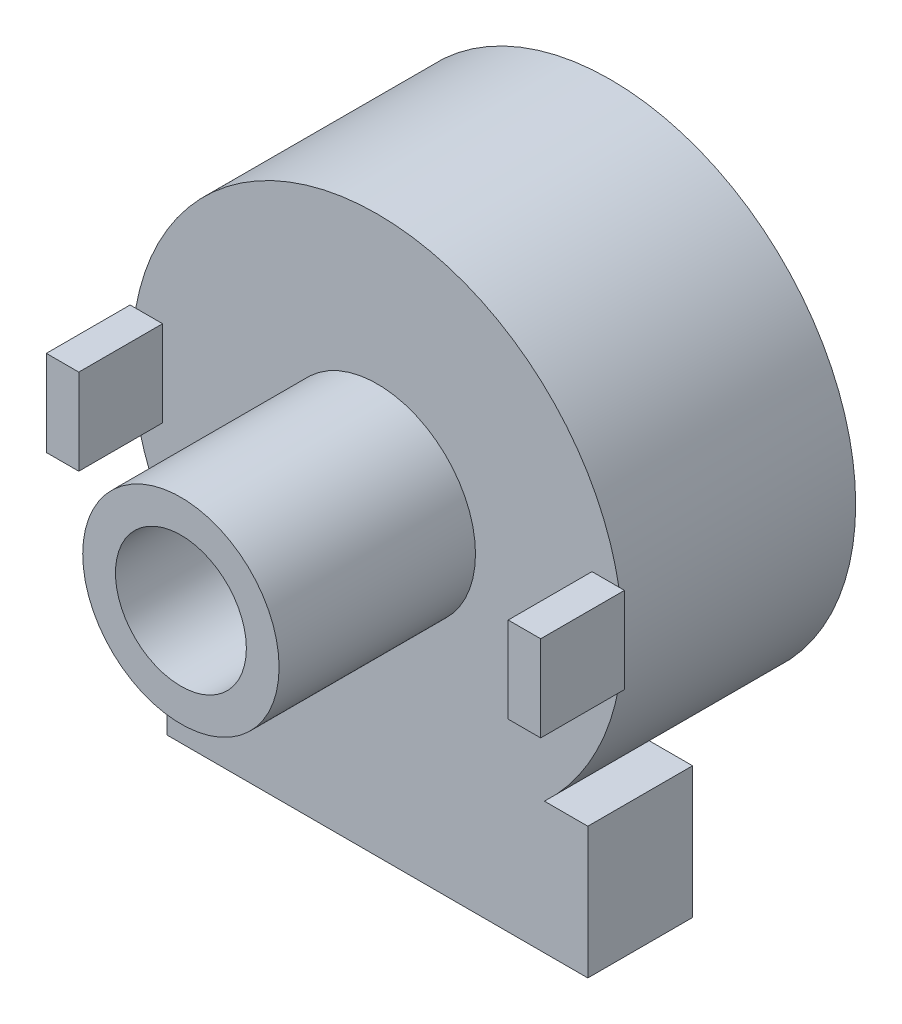
ISO-10303-21;
HEADER;
FILE_DESCRIPTION(('STEP AP214'),'2;1');
FILE_NAME('part.step','',(''),(''),'','','');
FILE_SCHEMA(('AUTOMOTIVE_DESIGN { 1 0 10303 214 1 1 1 1 }'));
ENDSEC;
DATA;
#1=APPLICATION_CONTEXT('core data for automotive mechanical design processes');
#2=APPLICATION_PROTOCOL_DEFINITION('international standard','automotive_design',2000,#1);
#3=PRODUCT_CONTEXT('',#1,'mechanical');
#4=PRODUCT('Part','Part','',(#3));
#5=PRODUCT_RELATED_PRODUCT_CATEGORY('part','',(#4));
#6=PRODUCT_DEFINITION_FORMATION('','',#4);
#7=PRODUCT_DEFINITION_CONTEXT('part definition',#1,'design');
#8=PRODUCT_DEFINITION('design','',#6,#7);
#9=PRODUCT_DEFINITION_SHAPE('','',#8);
#10=(LENGTH_UNIT() NAMED_UNIT(*) SI_UNIT(.MILLI.,.METRE.));
#11=(NAMED_UNIT(*) PLANE_ANGLE_UNIT() SI_UNIT($,.RADIAN.));
#12=(NAMED_UNIT(*) SI_UNIT($,.STERADIAN.) SOLID_ANGLE_UNIT());
#13=UNCERTAINTY_MEASURE_WITH_UNIT(LENGTH_MEASURE(1.E-05),#10,'distance_accuracy_value','');
#14=(GEOMETRIC_REPRESENTATION_CONTEXT(3) GLOBAL_UNCERTAINTY_ASSIGNED_CONTEXT((#13)) GLOBAL_UNIT_ASSIGNED_CONTEXT((#10,
#11,#12)) REPRESENTATION_CONTEXT('',''));
#15=CARTESIAN_POINT('',(0.,0.,0.));
#16=DIRECTION('',(0.,0.,1.));
#17=DIRECTION('',(1.,0.,0.));
#18=AXIS2_PLACEMENT_3D('',#15,#16,#17);
#19=CARTESIAN_POINT('',(0.,0.,0.));
#20=DIRECTION('',(0.,0.,1.));
#21=DIRECTION('',(1.,0.,0.));
#22=AXIS2_PLACEMENT_3D('',#19,#20,#21);
#23=PLANE('',#22);
#24=CARTESIAN_POINT('',(0.,0.,0.));
#25=DIRECTION('',(0.,0.,1.));
#26=DIRECTION('',(1.,0.,0.));
#27=AXIS2_PLACEMENT_3D('',#24,#25,#26);
#28=CIRCLE('',#27,11.8999);
#29=CARTESIAN_POINT('',(-11.7162094625352,-2.0828,0.));
#30=VERTEX_POINT('',#29);
#31=CARTESIAN_POINT('',(-8.10587386837471,-8.7122,0.));
#32=VERTEX_POINT('',#31);
#33=EDGE_CURVE('E275',#30,#32,#28,.T.);
#34=ORIENTED_EDGE('',*,*,#33,.T.);
#35=DIRECTION('',(-1.,0.,0.));
#36=VECTOR('',#35,1.);
#37=CARTESIAN_POINT('',(-10.2108,-8.7122,0.));
#38=LINE('',#37,#36);
#39=CARTESIAN_POINT('',(-10.2108,-8.7122,0.));
#40=VERTEX_POINT('',#39);
#41=EDGE_CURVE('E182',#32,#40,#38,.T.);
#42=ORIENTED_EDGE('',*,*,#41,.T.);
#43=DIRECTION('',(0.,-1.,0.));
#44=VECTOR('',#43,1.);
#45=CARTESIAN_POINT('',(-10.2108,-8.7122,0.));
#46=LINE('',#45,#44);
#47=CARTESIAN_POINT('',(-10.2108,-15.0876,0.));
#48=VERTEX_POINT('',#47);
#49=EDGE_CURVE('E174',#40,#48,#46,.T.);
#50=ORIENTED_EDGE('',*,*,#49,.T.);
#51=DIRECTION('',(1.,0.,0.));
#52=VECTOR('',#51,1.);
#53=CARTESIAN_POINT('',(-10.2108,-15.0876,0.));
#54=LINE('',#53,#52);
#55=CARTESIAN_POINT('',(10.2108,-15.0876,0.));
#56=VERTEX_POINT('',#55);
#57=EDGE_CURVE('E171',#48,#56,#54,.T.);
#58=ORIENTED_EDGE('',*,*,#57,.T.);
#59=DIRECTION('',(0.,1.,0.));
#60=VECTOR('',#59,1.);
#61=CARTESIAN_POINT('',(10.2108,-8.7122,0.));
#62=LINE('',#61,#60);
#63=CARTESIAN_POINT('',(10.2108,-8.7122,0.));
#64=VERTEX_POINT('',#63);
#65=EDGE_CURVE('E180',#56,#64,#62,.T.);
#66=ORIENTED_EDGE('',*,*,#65,.T.);
#67=CARTESIAN_POINT('',(8.10587386837471,-8.7122,0.));
#68=VERTEX_POINT('',#67);
#69=EDGE_CURVE('E49',#64,#68,#38,.T.);
#70=ORIENTED_EDGE('',*,*,#69,.T.);
#71=CARTESIAN_POINT('',(11.7162094625352,-2.0828,0.));
#72=VERTEX_POINT('',#71);
#73=EDGE_CURVE('E276',#68,#72,#28,.T.);
#74=ORIENTED_EDGE('',*,*,#73,.T.);
#75=DIRECTION('',(1.,0.,0.));
#76=VECTOR('',#75,1.);
#77=CARTESIAN_POINT('',(10.414,-2.0828,0.));
#78=LINE('',#77,#76);
#79=CARTESIAN_POINT('',(10.414,-2.0828,0.));
#80=VERTEX_POINT('',#79);
#81=EDGE_CURVE('E202',#80,#72,#78,.T.);
#82=ORIENTED_EDGE('',*,*,#81,.F.);
#83=DIRECTION('',(0.,-1.,0.));
#84=VECTOR('',#83,1.);
#85=CARTESIAN_POINT('',(10.414,2.0828,0.));
#86=LINE('',#85,#84);
#87=CARTESIAN_POINT('',(10.414,2.0828,0.));
#88=VERTEX_POINT('',#87);
#89=EDGE_CURVE('E56',#88,#80,#86,.T.);
#90=ORIENTED_EDGE('',*,*,#89,.F.);
#91=DIRECTION('',(-1.,0.,0.));
#92=VECTOR('',#91,1.);
#93=CARTESIAN_POINT('',(10.414,2.0828,0.));
#94=LINE('',#93,#92);
#95=CARTESIAN_POINT('',(11.7162094625352,2.0828,0.));
#96=VERTEX_POINT('',#95);
#97=EDGE_CURVE('E211',#96,#88,#94,.T.);
#98=ORIENTED_EDGE('',*,*,#97,.F.);
#99=CARTESIAN_POINT('',(-11.7162094625352,2.0828,0.));
#100=VERTEX_POINT('',#99);
#101=EDGE_CURVE('E265',#96,#100,#28,.T.);
#102=ORIENTED_EDGE('',*,*,#101,.T.);
#103=DIRECTION('',(-1.,0.,0.));
#104=VECTOR('',#103,1.);
#105=CARTESIAN_POINT('',(-11.9888,2.0828,0.));
#106=LINE('',#105,#104);
#107=CARTESIAN_POINT('',(-10.414,2.0828,0.));
#108=VERTEX_POINT('',#107);
#109=EDGE_CURVE('E245',#108,#100,#106,.T.);
#110=ORIENTED_EDGE('',*,*,#109,.F.);
#111=DIRECTION('',(0.,1.,0.));
#112=VECTOR('',#111,1.);
#113=CARTESIAN_POINT('',(-10.414,-2.0828,0.));
#114=LINE('',#113,#112);
#115=CARTESIAN_POINT('',(-10.414,-2.0828,0.));
#116=VERTEX_POINT('',#115);
#117=EDGE_CURVE('E230',#116,#108,#114,.T.);
#118=ORIENTED_EDGE('',*,*,#117,.F.);
#119=DIRECTION('',(-1.,0.,0.));
#120=VECTOR('',#119,1.);
#121=CARTESIAN_POINT('',(0.,-2.0828,0.));
#122=LINE('',#121,#120);
#123=EDGE_CURVE('E271',#116,#30,#122,.T.);
#124=ORIENTED_EDGE('',*,*,#123,.T.);
#125=EDGE_LOOP('',(#34,#42,#50,#58,#66,#70,#74,#82,#90,#98,#102,#110,#118,#124));
#126=FACE_BOUND('',#125,.T.);
#127=CARTESIAN_POINT('',(0.,0.,0.));
#128=DIRECTION('',(0.,0.,1.));
#129=DIRECTION('',(1.,0.,0.));
#130=AXIS2_PLACEMENT_3D('',#127,#128,#129);
#131=CIRCLE('',#130,4.7625);
#132=CARTESIAN_POINT('',(4.7625,0.,0.));
#133=VERTEX_POINT('',#132);
#134=EDGE_CURVE('E261',#133,#133,#131,.T.);
#135=ORIENTED_EDGE('',*,*,#134,.F.);
#136=EDGE_LOOP('',(#135));
#137=FACE_BOUND('',#136,.T.);
#138=ADVANCED_FACE('F34',(#126,#137),#23,.T.);
#139=CARTESIAN_POINT('',(0.,0.,-11.303));
#140=DIRECTION('',(0.,0.,1.));
#141=DIRECTION('',(1.,0.,0.));
#142=AXIS2_PLACEMENT_3D('',#139,#140,#141);
#143=CYLINDRICAL_SURFACE('',#142,11.8999);
#144=DIRECTION('',(0.,0.,1.));
#145=VECTOR('',#144,1.);
#146=CARTESIAN_POINT('',(-8.10587386837471,-8.7122,-11.303));
#147=LINE('',#146,#145);
#148=CARTESIAN_POINT('',(-8.10587386837471,-8.7122,-5.08));
#149=VERTEX_POINT('',#148);
#150=EDGE_CURVE('E12',#32,#149,#147,.F.);
#151=ORIENTED_EDGE('',*,*,#150,.F.);
#152=ORIENTED_EDGE('',*,*,#33,.F.);
#153=EDGE_CURVE('E272',#100,#30,#28,.T.);
#154=ORIENTED_EDGE('',*,*,#153,.F.);
#155=ORIENTED_EDGE('',*,*,#101,.F.);
#156=EDGE_CURVE('E285',#72,#96,#28,.T.);
#157=ORIENTED_EDGE('',*,*,#156,.F.);
#158=ORIENTED_EDGE('',*,*,#73,.F.);
#159=DIRECTION('',(0.,0.,1.));
#160=VECTOR('',#159,1.);
#161=CARTESIAN_POINT('',(8.10587386837471,-8.7122,-11.303));
#162=LINE('',#161,#160);
#163=CARTESIAN_POINT('',(8.10587386837471,-8.7122,-5.08));
#164=VERTEX_POINT('',#163);
#165=EDGE_CURVE('E42',#164,#68,#162,.T.);
#166=ORIENTED_EDGE('',*,*,#165,.F.);
#167=CARTESIAN_POINT('',(0.,0.,-5.08));
#168=DIRECTION('',(0.,0.,1.));
#169=DIRECTION('',(1.,0.,0.));
#170=AXIS2_PLACEMENT_3D('',#167,#168,#169);
#171=CIRCLE('',#170,11.8999);
#172=EDGE_CURVE('E165',#164,#149,#171,.F.);
#173=ORIENTED_EDGE('',*,*,#172,.T.);
#174=EDGE_LOOP('',(#151,#152,#154,#155,#157,#158,#166,#173));
#175=FACE_BOUND('',#174,.T.);
#176=CARTESIAN_POINT('',(0.,0.,-11.303));
#177=DIRECTION('',(0.,0.,1.));
#178=DIRECTION('',(1.,0.,0.));
#179=AXIS2_PLACEMENT_3D('',#176,#177,#178);
#180=CIRCLE('',#179,11.8999);
#181=CARTESIAN_POINT('',(11.8999,0.,-11.303));
#182=VERTEX_POINT('',#181);
#183=EDGE_CURVE('E268',#182,#182,#180,.T.);
#184=ORIENTED_EDGE('',*,*,#183,.T.);
#185=EDGE_LOOP('',(#184));
#186=FACE_BOUND('',#185,.T.);
#187=ADVANCED_FACE('F36',(#175,#186),#143,.T.);
#188=CARTESIAN_POINT('',(0.,0.,-11.303));
#189=DIRECTION('',(0.,0.,1.));
#190=DIRECTION('',(1.,0.,0.));
#191=AXIS2_PLACEMENT_3D('',#188,#189,#190);
#192=PLANE('',#191);
#193=ORIENTED_EDGE('',*,*,#183,.F.);
#194=EDGE_LOOP('',(#193));
#195=FACE_BOUND('',#194,.T.);
#196=ADVANCED_FACE('F327',(#195),#192,.F.);
#197=CARTESIAN_POINT('',(0.,0.,9.525));
#198=DIRECTION('',(0.,0.,-1.));
#199=DIRECTION('',(-1.,0.,0.));
#200=AXIS2_PLACEMENT_3D('',#197,#198,#199);
#201=CYLINDRICAL_SURFACE('',#200,4.7625);
#202=CARTESIAN_POINT('',(0.,0.,9.525));
#203=DIRECTION('',(0.,0.,1.));
#204=DIRECTION('',(1.,0.,0.));
#205=AXIS2_PLACEMENT_3D('',#202,#203,#204);
#206=CIRCLE('',#205,4.7625);
#207=CARTESIAN_POINT('',(4.7625,0.,9.525));
#208=VERTEX_POINT('',#207);
#209=EDGE_CURVE('E262',#208,#208,#206,.T.);
#210=ORIENTED_EDGE('',*,*,#209,.F.);
#211=EDGE_LOOP('',(#210));
#212=FACE_BOUND('',#211,.T.);
#213=ORIENTED_EDGE('',*,*,#134,.T.);
#214=EDGE_LOOP('',(#213));
#215=FACE_BOUND('',#214,.T.);
#216=ADVANCED_FACE('F331',(#212,#215),#201,.T.);
#217=CARTESIAN_POINT('',(0.,0.,9.525));
#218=DIRECTION('',(0.,0.,1.));
#219=DIRECTION('',(1.,0.,0.));
#220=AXIS2_PLACEMENT_3D('',#217,#218,#219);
#221=PLANE('',#220);
#222=CARTESIAN_POINT('',(0.,0.,9.525));
#223=DIRECTION('',(0.,0.,1.));
#224=DIRECTION('',(1.,0.,0.));
#225=AXIS2_PLACEMENT_3D('',#222,#223,#224);
#226=CIRCLE('',#225,3.175);
#227=CARTESIAN_POINT('',(3.175,0.,9.525));
#228=VERTEX_POINT('',#227);
#229=EDGE_CURVE('E187',#228,#228,#226,.T.);
#230=ORIENTED_EDGE('',*,*,#229,.F.);
#231=EDGE_LOOP('',(#230));
#232=FACE_BOUND('',#231,.T.);
#233=ORIENTED_EDGE('',*,*,#209,.T.);
#234=EDGE_LOOP('',(#233));
#235=FACE_BOUND('',#234,.T.);
#236=ADVANCED_FACE('F335',(#232,#235),#221,.T.);
#237=CARTESIAN_POINT('',(-10.414,-2.0828,4.064));
#238=DIRECTION('',(-1.,0.,0.));
#239=DIRECTION('',(0.,0.,1.));
#240=AXIS2_PLACEMENT_3D('',#237,#238,#239);
#241=PLANE('',#240);
#242=ORIENTED_EDGE('',*,*,#117,.T.);
#243=DIRECTION('',(0.,0.,-1.));
#244=VECTOR('',#243,1.);
#245=CARTESIAN_POINT('',(-10.414,2.0828,4.064));
#246=LINE('',#245,#244);
#247=CARTESIAN_POINT('',(-10.414,2.0828,4.064));
#248=VERTEX_POINT('',#247);
#249=EDGE_CURVE('E259',#248,#108,#246,.T.);
#250=ORIENTED_EDGE('',*,*,#249,.F.);
#251=DIRECTION('',(0.,1.,0.));
#252=VECTOR('',#251,1.);
#253=CARTESIAN_POINT('',(-10.414,-2.0828,4.064));
#254=LINE('',#253,#252);
#255=CARTESIAN_POINT('',(-10.414,-2.0828,4.064));
#256=VERTEX_POINT('',#255);
#257=EDGE_CURVE('E231',#256,#248,#254,.T.);
#258=ORIENTED_EDGE('',*,*,#257,.F.);
#259=DIRECTION('',(0.,0.,-1.));
#260=VECTOR('',#259,1.);
#261=CARTESIAN_POINT('',(-10.414,-2.0828,4.064));
#262=LINE('',#261,#260);
#263=EDGE_CURVE('E241',#256,#116,#262,.T.);
#264=ORIENTED_EDGE('',*,*,#263,.T.);
#265=EDGE_LOOP('',(#242,#250,#258,#264));
#266=FACE_BOUND('',#265,.T.);
#267=ADVANCED_FACE('F308',(#266),#241,.F.);
#268=CARTESIAN_POINT('',(-11.9888,2.0828,4.064));
#269=DIRECTION('',(0.,-1.,0.));
#270=DIRECTION('',(1.,0.,0.));
#271=AXIS2_PLACEMENT_3D('',#268,#269,#270);
#272=PLANE('',#271);
#273=ORIENTED_EDGE('',*,*,#109,.T.);
#274=CARTESIAN_POINT('',(-11.9888,2.0828,0.));
#275=VERTEX_POINT('',#274);
#276=EDGE_CURVE('E244',#100,#275,#106,.T.);
#277=ORIENTED_EDGE('',*,*,#276,.T.);
#278=DIRECTION('',(0.,0.,-1.));
#279=VECTOR('',#278,1.);
#280=CARTESIAN_POINT('',(-11.9888,2.0828,4.064));
#281=LINE('',#280,#279);
#282=CARTESIAN_POINT('',(-11.9888,2.0828,4.064));
#283=VERTEX_POINT('',#282);
#284=EDGE_CURVE('E256',#283,#275,#281,.T.);
#285=ORIENTED_EDGE('',*,*,#284,.F.);
#286=DIRECTION('',(-1.,0.,0.));
#287=VECTOR('',#286,1.);
#288=CARTESIAN_POINT('',(-11.9888,2.0828,4.064));
#289=LINE('',#288,#287);
#290=EDGE_CURVE('E234',#248,#283,#289,.T.);
#291=ORIENTED_EDGE('',*,*,#290,.F.);
#292=ORIENTED_EDGE('',*,*,#249,.T.);
#293=EDGE_LOOP('',(#273,#277,#285,#291,#292));
#294=FACE_BOUND('',#293,.T.);
#295=ADVANCED_FACE('F299',(#294),#272,.F.);
#296=CARTESIAN_POINT('',(-11.9888,-2.0828,4.064));
#297=DIRECTION('',(1.,0.,0.));
#298=DIRECTION('',(0.,0.,-1.));
#299=AXIS2_PLACEMENT_3D('',#296,#297,#298);
#300=PLANE('',#299);
#301=DIRECTION('',(0.,-1.,0.));
#302=VECTOR('',#301,1.);
#303=CARTESIAN_POINT('',(-11.9888,-2.0828,0.));
#304=LINE('',#303,#302);
#305=CARTESIAN_POINT('',(-11.9888,-2.0828,0.));
#306=VERTEX_POINT('',#305);
#307=EDGE_CURVE('E248',#275,#306,#304,.T.);
#308=ORIENTED_EDGE('',*,*,#307,.T.);
#309=DIRECTION('',(0.,0.,-1.));
#310=VECTOR('',#309,1.);
#311=CARTESIAN_POINT('',(-11.9888,-2.0828,4.064));
#312=LINE('',#311,#310);
#313=CARTESIAN_POINT('',(-11.9888,-2.0828,4.064));
#314=VERTEX_POINT('',#313);
#315=EDGE_CURVE('E253',#314,#306,#312,.T.);
#316=ORIENTED_EDGE('',*,*,#315,.F.);
#317=DIRECTION('',(0.,-1.,0.));
#318=VECTOR('',#317,1.);
#319=CARTESIAN_POINT('',(-11.9888,-2.0828,4.064));
#320=LINE('',#319,#318);
#321=EDGE_CURVE('E237',#283,#314,#320,.T.);
#322=ORIENTED_EDGE('',*,*,#321,.F.);
#323=ORIENTED_EDGE('',*,*,#284,.T.);
#324=EDGE_LOOP('',(#308,#316,#322,#323));
#325=FACE_BOUND('',#324,.T.);
#326=ADVANCED_FACE('F314',(#325),#300,.F.);
#327=CARTESIAN_POINT('',(-11.9888,-2.0828,4.064));
#328=DIRECTION('',(0.,1.,0.));
#329=DIRECTION('',(-1.,0.,0.));
#330=AXIS2_PLACEMENT_3D('',#327,#328,#329);
#331=PLANE('',#330);
#332=DIRECTION('',(1.,0.,0.));
#333=VECTOR('',#332,1.);
#334=CARTESIAN_POINT('',(-11.9888,-2.0828,0.));
#335=LINE('',#334,#333);
#336=EDGE_CURVE('E235',#306,#30,#335,.T.);
#337=ORIENTED_EDGE('',*,*,#336,.T.);
#338=ORIENTED_EDGE('',*,*,#123,.F.);
#339=ORIENTED_EDGE('',*,*,#263,.F.);
#340=DIRECTION('',(1.,0.,0.));
#341=VECTOR('',#340,1.);
#342=CARTESIAN_POINT('',(-11.9888,-2.0828,4.064));
#343=LINE('',#342,#341);
#344=EDGE_CURVE('E239',#314,#256,#343,.T.);
#345=ORIENTED_EDGE('',*,*,#344,.F.);
#346=ORIENTED_EDGE('',*,*,#315,.T.);
#347=EDGE_LOOP('',(#337,#338,#339,#345,#346));
#348=FACE_BOUND('',#347,.T.);
#349=ADVANCED_FACE('F304',(#348),#331,.F.);
#350=CARTESIAN_POINT('',(0.,0.,4.064));
#351=DIRECTION('',(0.,0.,-1.));
#352=DIRECTION('',(-1.,0.,0.));
#353=AXIS2_PLACEMENT_3D('',#350,#351,#352);
#354=PLANE('',#353);
#355=ORIENTED_EDGE('',*,*,#257,.T.);
#356=ORIENTED_EDGE('',*,*,#290,.T.);
#357=ORIENTED_EDGE('',*,*,#321,.T.);
#358=ORIENTED_EDGE('',*,*,#344,.T.);
#359=EDGE_LOOP('',(#355,#356,#357,#358));
#360=FACE_BOUND('',#359,.T.);
#361=ADVANCED_FACE('F310',(#360),#354,.F.);
#362=CARTESIAN_POINT('',(0.,0.,0.));
#363=DIRECTION('',(0.,0.,-1.));
#364=DIRECTION('',(-1.,0.,0.));
#365=AXIS2_PLACEMENT_3D('',#362,#363,#364);
#366=PLANE('',#365);
#367=ORIENTED_EDGE('',*,*,#276,.F.);
#368=ORIENTED_EDGE('',*,*,#153,.T.);
#369=ORIENTED_EDGE('',*,*,#336,.F.);
#370=ORIENTED_EDGE('',*,*,#307,.F.);
#371=EDGE_LOOP('',(#367,#368,#369,#370));
#372=FACE_BOUND('',#371,.T.);
#373=ADVANCED_FACE('F295',(#372),#366,.T.);
#374=CARTESIAN_POINT('',(11.9888,2.0828,4.064));
#375=DIRECTION('',(-1.,0.,0.));
#376=DIRECTION('',(0.,0.,1.));
#377=AXIS2_PLACEMENT_3D('',#374,#375,#376);
#378=PLANE('',#377);
#379=DIRECTION('',(0.,1.,0.));
#380=VECTOR('',#379,1.);
#381=CARTESIAN_POINT('',(11.9888,2.0828,0.));
#382=LINE('',#381,#380);
#383=CARTESIAN_POINT('',(11.9888,-2.0828,0.));
#384=VERTEX_POINT('',#383);
#385=CARTESIAN_POINT('',(11.9888,2.0828,0.));
#386=VERTEX_POINT('',#385);
#387=EDGE_CURVE('E195',#384,#386,#382,.T.);
#388=ORIENTED_EDGE('',*,*,#387,.T.);
#389=DIRECTION('',(0.,0.,-1.));
#390=VECTOR('',#389,1.);
#391=CARTESIAN_POINT('',(11.9888,2.0828,4.064));
#392=LINE('',#391,#390);
#393=CARTESIAN_POINT('',(11.9888,2.0828,4.064));
#394=VERTEX_POINT('',#393);
#395=EDGE_CURVE('E227',#394,#386,#392,.T.);
#396=ORIENTED_EDGE('',*,*,#395,.F.);
#397=DIRECTION('',(0.,1.,0.));
#398=VECTOR('',#397,1.);
#399=CARTESIAN_POINT('',(11.9888,2.0828,4.064));
#400=LINE('',#399,#398);
#401=CARTESIAN_POINT('',(11.9888,-2.0828,4.064));
#402=VERTEX_POINT('',#401);
#403=EDGE_CURVE('E198',#402,#394,#400,.T.);
#404=ORIENTED_EDGE('',*,*,#403,.F.);
#405=DIRECTION('',(0.,0.,-1.));
#406=VECTOR('',#405,1.);
#407=CARTESIAN_POINT('',(11.9888,-2.0828,4.064));
#408=LINE('',#407,#406);
#409=EDGE_CURVE('E208',#402,#384,#408,.T.);
#410=ORIENTED_EDGE('',*,*,#409,.T.);
#411=EDGE_LOOP('',(#388,#396,#404,#410));
#412=FACE_BOUND('',#411,.T.);
#413=ADVANCED_FACE('F377',(#412),#378,.F.);
#414=CARTESIAN_POINT('',(10.414,2.0828,4.064));
#415=DIRECTION('',(0.,-1.,0.));
#416=DIRECTION('',(0.,0.,-1.));
#417=AXIS2_PLACEMENT_3D('',#414,#415,#416);
#418=PLANE('',#417);
#419=EDGE_CURVE('E212',#386,#96,#94,.T.);
#420=ORIENTED_EDGE('',*,*,#419,.T.);
#421=ORIENTED_EDGE('',*,*,#97,.T.);
#422=DIRECTION('',(0.,0.,-1.));
#423=VECTOR('',#422,1.);
#424=CARTESIAN_POINT('',(10.414,2.0828,4.064));
#425=LINE('',#424,#423);
#426=CARTESIAN_POINT('',(10.414,2.0828,4.064));
#427=VERTEX_POINT('',#426);
#428=EDGE_CURVE('E224',#427,#88,#425,.T.);
#429=ORIENTED_EDGE('',*,*,#428,.F.);
#430=DIRECTION('',(-1.,0.,0.));
#431=VECTOR('',#430,1.);
#432=CARTESIAN_POINT('',(10.414,2.0828,4.064));
#433=LINE('',#432,#431);
#434=EDGE_CURVE('E201',#394,#427,#433,.T.);
#435=ORIENTED_EDGE('',*,*,#434,.F.);
#436=ORIENTED_EDGE('',*,*,#395,.T.);
#437=EDGE_LOOP('',(#420,#421,#429,#435,#436));
#438=FACE_BOUND('',#437,.T.);
#439=ADVANCED_FACE('F386',(#438),#418,.F.);
#440=CARTESIAN_POINT('',(10.414,2.0828,4.064));
#441=DIRECTION('',(1.,0.,0.));
#442=DIRECTION('',(0.,0.,-1.));
#443=AXIS2_PLACEMENT_3D('',#440,#441,#442);
#444=PLANE('',#443);
#445=ORIENTED_EDGE('',*,*,#89,.T.);
#446=DIRECTION('',(0.,0.,-1.));
#447=VECTOR('',#446,1.);
#448=CARTESIAN_POINT('',(10.414,-2.0828,4.064));
#449=LINE('',#448,#447);
#450=CARTESIAN_POINT('',(10.414,-2.0828,4.064));
#451=VERTEX_POINT('',#450);
#452=EDGE_CURVE('E221',#451,#80,#449,.T.);
#453=ORIENTED_EDGE('',*,*,#452,.F.);
#454=DIRECTION('',(0.,-1.,0.));
#455=VECTOR('',#454,1.);
#456=CARTESIAN_POINT('',(10.414,2.0828,4.064));
#457=LINE('',#456,#455);
#458=EDGE_CURVE('E204',#427,#451,#457,.T.);
#459=ORIENTED_EDGE('',*,*,#458,.F.);
#460=ORIENTED_EDGE('',*,*,#428,.T.);
#461=EDGE_LOOP('',(#445,#453,#459,#460));
#462=FACE_BOUND('',#461,.T.);
#463=ADVANCED_FACE('F396',(#462),#444,.F.);
#464=CARTESIAN_POINT('',(10.414,-2.0828,4.064));
#465=DIRECTION('',(0.,1.,0.));
#466=DIRECTION('',(0.,0.,1.));
#467=AXIS2_PLACEMENT_3D('',#464,#465,#466);
#468=PLANE('',#467);
#469=ORIENTED_EDGE('',*,*,#81,.T.);
#470=EDGE_CURVE('E216',#72,#384,#78,.T.);
#471=ORIENTED_EDGE('',*,*,#470,.T.);
#472=ORIENTED_EDGE('',*,*,#409,.F.);
#473=DIRECTION('',(1.,0.,0.));
#474=VECTOR('',#473,1.);
#475=CARTESIAN_POINT('',(10.414,-2.0828,4.064));
#476=LINE('',#475,#474);
#477=EDGE_CURVE('E206',#451,#402,#476,.T.);
#478=ORIENTED_EDGE('',*,*,#477,.F.);
#479=ORIENTED_EDGE('',*,*,#452,.T.);
#480=EDGE_LOOP('',(#469,#471,#472,#478,#479));
#481=FACE_BOUND('',#480,.T.);
#482=ADVANCED_FACE('F406',(#481),#468,.F.);
#483=CARTESIAN_POINT('',(0.,0.,4.064));
#484=DIRECTION('',(0.,0.,1.));
#485=DIRECTION('',(1.,0.,0.));
#486=AXIS2_PLACEMENT_3D('',#483,#484,#485);
#487=PLANE('',#486);
#488=ORIENTED_EDGE('',*,*,#403,.T.);
#489=ORIENTED_EDGE('',*,*,#434,.T.);
#490=ORIENTED_EDGE('',*,*,#458,.T.);
#491=ORIENTED_EDGE('',*,*,#477,.T.);
#492=EDGE_LOOP('',(#488,#489,#490,#491));
#493=FACE_BOUND('',#492,.T.);
#494=ADVANCED_FACE('F416',(#493),#487,.T.);
#495=CARTESIAN_POINT('',(0.,0.,0.));
#496=DIRECTION('',(0.,0.,1.));
#497=DIRECTION('',(1.,0.,0.));
#498=AXIS2_PLACEMENT_3D('',#495,#496,#497);
#499=PLANE('',#498);
#500=ORIENTED_EDGE('',*,*,#156,.T.);
#501=ORIENTED_EDGE('',*,*,#419,.F.);
#502=ORIENTED_EDGE('',*,*,#387,.F.);
#503=ORIENTED_EDGE('',*,*,#470,.F.);
#504=EDGE_LOOP('',(#500,#501,#502,#503));
#505=FACE_BOUND('',#504,.T.);
#506=ADVANCED_FACE('F426',(#505),#499,.F.);
#507=CARTESIAN_POINT('',(0.,0.,0.));
#508=DIRECTION('',(0.,0.,1.));
#509=DIRECTION('',(1.,0.,0.));
#510=AXIS2_PLACEMENT_3D('',#507,#508,#509);
#511=CYLINDRICAL_SURFACE('',#510,3.175);
#512=CARTESIAN_POINT('',(0.,0.,0.));
#513=DIRECTION('',(0.,0.,1.));
#514=DIRECTION('',(1.,0.,0.));
#515=AXIS2_PLACEMENT_3D('',#512,#513,#514);
#516=CIRCLE('',#515,3.175);
#517=CARTESIAN_POINT('',(3.175,0.,0.));
#518=VERTEX_POINT('',#517);
#519=EDGE_CURVE('E192',#518,#518,#516,.T.);
#520=ORIENTED_EDGE('',*,*,#519,.F.);
#521=EDGE_LOOP('',(#520));
#522=FACE_BOUND('',#521,.T.);
#523=ORIENTED_EDGE('',*,*,#229,.T.);
#524=EDGE_LOOP('',(#523));
#525=FACE_BOUND('',#524,.T.);
#526=ADVANCED_FACE('F435',(#522,#525),#511,.F.);
#527=CARTESIAN_POINT('',(0.,0.,0.));
#528=DIRECTION('',(0.,0.,1.));
#529=DIRECTION('',(1.,0.,0.));
#530=AXIS2_PLACEMENT_3D('',#527,#528,#529);
#531=PLANE('',#530);
#532=ORIENTED_EDGE('',*,*,#519,.T.);
#533=EDGE_LOOP('',(#532));
#534=FACE_BOUND('',#533,.T.);
#535=ADVANCED_FACE('F452',(#534),#531,.T.);
#536=CARTESIAN_POINT('',(-10.2108,-8.7122,-5.08));
#537=DIRECTION('',(0.,1.,0.));
#538=DIRECTION('',(0.,0.,1.));
#539=AXIS2_PLACEMENT_3D('',#536,#537,#538);
#540=PLANE('',#539);
#541=ORIENTED_EDGE('',*,*,#41,.F.);
#542=ORIENTED_EDGE('',*,*,#150,.T.);
#543=DIRECTION('',(-1.,0.,0.));
#544=VECTOR('',#543,1.);
#545=CARTESIAN_POINT('',(-10.2108,-8.7122,-5.08));
#546=LINE('',#545,#544);
#547=CARTESIAN_POINT('',(-10.2108,-8.7122,-5.08));
#548=VERTEX_POINT('',#547);
#549=EDGE_CURVE('E167',#149,#548,#546,.T.);
#550=ORIENTED_EDGE('',*,*,#549,.T.);
#551=DIRECTION('',(0.,0.,1.));
#552=VECTOR('',#551,1.);
#553=CARTESIAN_POINT('',(-10.2108,-8.7122,-5.08));
#554=LINE('',#553,#552);
#555=EDGE_CURVE('E154',#548,#40,#554,.T.);
#556=ORIENTED_EDGE('',*,*,#555,.T.);
#557=EDGE_LOOP('',(#541,#542,#550,#556));
#558=FACE_BOUND('',#557,.T.);
#559=ADVANCED_FACE('F461',(#558),#540,.T.);
#560=CARTESIAN_POINT('',(10.2108,-8.7122,-5.08));
#561=DIRECTION('',(1.,0.,0.));
#562=DIRECTION('',(0.,0.,-1.));
#563=AXIS2_PLACEMENT_3D('',#560,#561,#562);
#564=PLANE('',#563);
#565=ORIENTED_EDGE('',*,*,#65,.F.);
#566=DIRECTION('',(0.,0.,1.));
#567=VECTOR('',#566,1.);
#568=CARTESIAN_POINT('',(10.2108,-15.0876,-5.08));
#569=LINE('',#568,#567);
#570=CARTESIAN_POINT('',(10.2108,-15.0876,-5.08));
#571=VERTEX_POINT('',#570);
#572=EDGE_CURVE('E170',#571,#56,#569,.T.);
#573=ORIENTED_EDGE('',*,*,#572,.F.);
#574=DIRECTION('',(0.,1.,0.));
#575=VECTOR('',#574,1.);
#576=CARTESIAN_POINT('',(10.2108,-8.7122,-5.08));
#577=LINE('',#576,#575);
#578=CARTESIAN_POINT('',(10.2108,-8.7122,-5.08));
#579=VERTEX_POINT('',#578);
#580=EDGE_CURVE('E161',#571,#579,#577,.T.);
#581=ORIENTED_EDGE('',*,*,#580,.T.);
#582=DIRECTION('',(0.,0.,1.));
#583=VECTOR('',#582,1.);
#584=CARTESIAN_POINT('',(10.2108,-8.7122,-5.08));
#585=LINE('',#584,#583);
#586=EDGE_CURVE('E146',#579,#64,#585,.T.);
#587=ORIENTED_EDGE('',*,*,#586,.T.);
#588=EDGE_LOOP('',(#565,#573,#581,#587));
#589=FACE_BOUND('',#588,.T.);
#590=ADVANCED_FACE('F169',(#589),#564,.T.);
#591=CARTESIAN_POINT('',(-10.2108,-15.0876,-5.08));
#592=DIRECTION('',(0.,-1.,0.));
#593=DIRECTION('',(0.,0.,-1.));
#594=AXIS2_PLACEMENT_3D('',#591,#592,#593);
#595=PLANE('',#594);
#596=ORIENTED_EDGE('',*,*,#57,.F.);
#597=DIRECTION('',(0.,0.,1.));
#598=VECTOR('',#597,1.);
#599=CARTESIAN_POINT('',(-10.2108,-15.0876,-5.08));
#600=LINE('',#599,#598);
#601=CARTESIAN_POINT('',(-10.2108,-15.0876,-5.08));
#602=VERTEX_POINT('',#601);
#603=EDGE_CURVE('E188',#602,#48,#600,.T.);
#604=ORIENTED_EDGE('',*,*,#603,.F.);
#605=DIRECTION('',(1.,0.,0.));
#606=VECTOR('',#605,1.);
#607=CARTESIAN_POINT('',(-10.2108,-15.0876,-5.08));
#608=LINE('',#607,#606);
#609=EDGE_CURVE('E155',#602,#571,#608,.T.);
#610=ORIENTED_EDGE('',*,*,#609,.T.);
#611=ORIENTED_EDGE('',*,*,#572,.T.);
#612=EDGE_LOOP('',(#596,#604,#610,#611));
#613=FACE_BOUND('',#612,.T.);
#614=ADVANCED_FACE('F492',(#613),#595,.T.);
#615=CARTESIAN_POINT('',(-10.2108,-8.7122,-5.08));
#616=DIRECTION('',(-1.,0.,0.));
#617=DIRECTION('',(0.,0.,1.));
#618=AXIS2_PLACEMENT_3D('',#615,#616,#617);
#619=PLANE('',#618);
#620=ORIENTED_EDGE('',*,*,#49,.F.);
#621=ORIENTED_EDGE('',*,*,#555,.F.);
#622=DIRECTION('',(0.,-1.,0.));
#623=VECTOR('',#622,1.);
#624=CARTESIAN_POINT('',(-10.2108,-8.7122,-5.08));
#625=LINE('',#624,#623);
#626=EDGE_CURVE('E166',#548,#602,#625,.T.);
#627=ORIENTED_EDGE('',*,*,#626,.T.);
#628=ORIENTED_EDGE('',*,*,#603,.T.);
#629=EDGE_LOOP('',(#620,#621,#627,#628));
#630=FACE_BOUND('',#629,.T.);
#631=ADVANCED_FACE('F501',(#630),#619,.T.);
#632=EDGE_CURVE('E149',#579,#164,#546,.T.);
#633=ORIENTED_EDGE('',*,*,#632,.T.);
#634=ORIENTED_EDGE('',*,*,#165,.T.);
#635=ORIENTED_EDGE('',*,*,#69,.F.);
#636=ORIENTED_EDGE('',*,*,#586,.F.);
#637=EDGE_LOOP('',(#633,#634,#635,#636));
#638=FACE_BOUND('',#637,.T.);
#639=ADVANCED_FACE('F148',(#638),#540,.T.);
#640=CARTESIAN_POINT('',(0.,0.,-5.08));
#641=DIRECTION('',(0.,0.,1.));
#642=DIRECTION('',(1.,0.,0.));
#643=AXIS2_PLACEMENT_3D('',#640,#641,#642);
#644=PLANE('',#643);
#645=ORIENTED_EDGE('',*,*,#172,.F.);
#646=ORIENTED_EDGE('',*,*,#632,.F.);
#647=ORIENTED_EDGE('',*,*,#580,.F.);
#648=ORIENTED_EDGE('',*,*,#609,.F.);
#649=ORIENTED_EDGE('',*,*,#626,.F.);
#650=ORIENTED_EDGE('',*,*,#549,.F.);
#651=EDGE_LOOP('',(#645,#646,#647,#648,#649,#650));
#652=FACE_BOUND('',#651,.T.);
#653=ADVANCED_FACE('F159',(#652),#644,.F.);
#654=CLOSED_SHELL('',(#138,#187,#196,#216,#236,#267,#295,#326,#349,#361,#373,#413,#439,#463,
#482,#494,#506,#526,#535,#559,#590,#614,#631,#639,#653));
#655=MANIFOLD_SOLID_BREP('B2',#654);
#656=ADVANCED_BREP_SHAPE_REPRESENTATION('',(#18,#655),#14);
#657=SHAPE_DEFINITION_REPRESENTATION(#9,#656);
ENDSEC;
END-ISO-10303-21;
